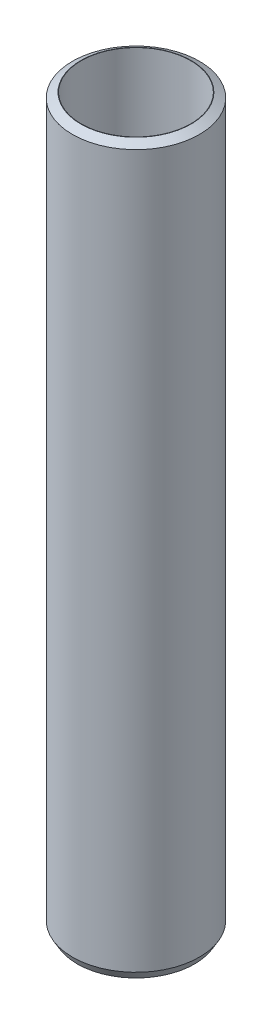
ISO-10303-21;
HEADER;
FILE_DESCRIPTION(('STEP AP214'),'2;1');
FILE_NAME('part.step','',(''),(''),'','','');
FILE_SCHEMA(('AUTOMOTIVE_DESIGN { 1 0 10303 214 1 1 1 1 }'));
ENDSEC;
DATA;
#1=APPLICATION_CONTEXT('core data for automotive mechanical design processes');
#2=APPLICATION_PROTOCOL_DEFINITION('international standard','automotive_design',2000,#1);
#3=PRODUCT_CONTEXT('',#1,'mechanical');
#4=PRODUCT('Part','Part','',(#3));
#5=PRODUCT_RELATED_PRODUCT_CATEGORY('part','',(#4));
#6=PRODUCT_DEFINITION_FORMATION('','',#4);
#7=PRODUCT_DEFINITION_CONTEXT('part definition',#1,'design');
#8=PRODUCT_DEFINITION('design','',#6,#7);
#9=PRODUCT_DEFINITION_SHAPE('','',#8);
#10=(LENGTH_UNIT() NAMED_UNIT(*) SI_UNIT(.MILLI.,.METRE.));
#11=(NAMED_UNIT(*) PLANE_ANGLE_UNIT() SI_UNIT($,.RADIAN.));
#12=(NAMED_UNIT(*) SI_UNIT($,.STERADIAN.) SOLID_ANGLE_UNIT());
#13=UNCERTAINTY_MEASURE_WITH_UNIT(LENGTH_MEASURE(1.E-05),#10,'distance_accuracy_value','');
#14=(GEOMETRIC_REPRESENTATION_CONTEXT(3) GLOBAL_UNCERTAINTY_ASSIGNED_CONTEXT((#13)) GLOBAL_UNIT_ASSIGNED_CONTEXT((#10,
#11,#12)) REPRESENTATION_CONTEXT('',''));
#15=CARTESIAN_POINT('',(0.,0.,0.));
#16=DIRECTION('',(0.,0.,1.));
#17=DIRECTION('',(1.,0.,0.));
#18=AXIS2_PLACEMENT_3D('',#15,#16,#17);
#19=CARTESIAN_POINT('',(0.,600.,0.));
#20=DIRECTION('',(0.,-1.,0.));
#21=DIRECTION('',(0.,0.,-1.));
#22=AXIS2_PLACEMENT_3D('',#19,#20,#21);
#23=CYLINDRICAL_SURFACE('',#22,52.5);
#24=CARTESIAN_POINT('',(0.,596.009307813276,0.));
#25=DIRECTION('',(0.,1.,0.));
#26=DIRECTION('',(0.,0.,1.));
#27=AXIS2_PLACEMENT_3D('',#24,#25,#26);
#28=CIRCLE('',#27,52.5);
#29=CARTESIAN_POINT('',(0.,596.009307813276,52.5));
#30=VERTEX_POINT('',#29);
#31=EDGE_CURVE('E50',#30,#30,#28,.F.);
#32=ORIENTED_EDGE('',*,*,#31,.T.);
#33=EDGE_LOOP('',(#32));
#34=FACE_BOUND('',#33,.T.);
#35=CARTESIAN_POINT('',(0.,6.91208162477497,0.));
#36=DIRECTION('',(0.,1.,0.));
#37=DIRECTION('',(0.,0.,1.));
#38=AXIS2_PLACEMENT_3D('',#35,#36,#37);
#39=CIRCLE('',#38,52.5);
#40=CARTESIAN_POINT('',(0.,6.91208162477497,52.5));
#41=VERTEX_POINT('',#40);
#42=EDGE_CURVE('E51',#41,#41,#39,.T.);
#43=ORIENTED_EDGE('',*,*,#42,.T.);
#44=EDGE_LOOP('',(#43));
#45=FACE_BOUND('',#44,.T.);
#46=ADVANCED_FACE('F39',(#34,#45),#23,.T.);
#47=CARTESIAN_POINT('',(0.,600.,0.));
#48=DIRECTION('',(0.,1.,0.));
#49=DIRECTION('',(0.,0.,1.));
#50=AXIS2_PLACEMENT_3D('',#47,#48,#49);
#51=PLANE('',#50);
#52=CARTESIAN_POINT('',(0.,600.,0.));
#53=DIRECTION('',(0.,1.,0.));
#54=DIRECTION('',(0.,0.,1.));
#55=AXIS2_PLACEMENT_3D('',#52,#53,#54);
#56=CIRCLE('',#55,45.5879183752254);
#57=CARTESIAN_POINT('',(0.,600.,45.5879183752254));
#58=VERTEX_POINT('',#57);
#59=EDGE_CURVE('E54',#58,#58,#56,.T.);
#60=ORIENTED_EDGE('',*,*,#59,.T.);
#61=EDGE_LOOP('',(#60));
#62=FACE_BOUND('',#61,.T.);
#63=CARTESIAN_POINT('',(0.,600.,0.));
#64=DIRECTION('',(0.,1.,0.));
#65=DIRECTION('',(0.,0.,1.));
#66=AXIS2_PLACEMENT_3D('',#63,#64,#65);
#67=CIRCLE('',#66,45.2888110798091);
#68=CARTESIAN_POINT('',(0.,600.,45.2888110798091));
#69=VERTEX_POINT('',#68);
#70=EDGE_CURVE('E58',#69,#69,#67,.T.);
#71=ORIENTED_EDGE('',*,*,#70,.F.);
#72=EDGE_LOOP('',(#71));
#73=FACE_BOUND('',#72,.T.);
#74=ADVANCED_FACE('F69',(#62,#73),#51,.T.);
#75=CARTESIAN_POINT('',(0.,0.,0.));
#76=DIRECTION('',(0.,1.,0.));
#77=DIRECTION('',(0.,0.,1.));
#78=AXIS2_PLACEMENT_3D('',#75,#76,#77);
#79=PLANE('',#78);
#80=CARTESIAN_POINT('',(0.,0.,0.));
#81=DIRECTION('',(0.,1.,0.));
#82=DIRECTION('',(0.,0.,1.));
#83=AXIS2_PLACEMENT_3D('',#80,#81,#82);
#84=CIRCLE('',#83,48.5093078132755);
#85=CARTESIAN_POINT('',(0.,0.,48.5093078132755));
#86=VERTEX_POINT('',#85);
#87=EDGE_CURVE('E10',#86,#86,#84,.F.);
#88=ORIENTED_EDGE('',*,*,#87,.T.);
#89=EDGE_LOOP('',(#88));
#90=FACE_BOUND('',#89,.T.);
#91=CARTESIAN_POINT('',(0.,0.,0.));
#92=DIRECTION('',(0.,1.,0.));
#93=DIRECTION('',(0.,0.,1.));
#94=AXIS2_PLACEMENT_3D('',#91,#92,#93);
#95=CIRCLE('',#94,45.2888110798091);
#96=CARTESIAN_POINT('',(0.,0.,45.2888110798091));
#97=VERTEX_POINT('',#96);
#98=EDGE_CURVE('E63',#97,#97,#95,.T.);
#99=ORIENTED_EDGE('',*,*,#98,.T.);
#100=EDGE_LOOP('',(#99));
#101=FACE_BOUND('',#100,.T.);
#102=ADVANCED_FACE('F75',(#90,#101),#79,.F.);
#103=CARTESIAN_POINT('',(0.,600.,0.));
#104=DIRECTION('',(0.,-1.,0.));
#105=DIRECTION('',(0.,0.,-1.));
#106=AXIS2_PLACEMENT_3D('',#103,#104,#105);
#107=CYLINDRICAL_SURFACE('',#106,45.2888110798091);
#108=ORIENTED_EDGE('',*,*,#70,.T.);
#109=EDGE_LOOP('',(#108));
#110=FACE_BOUND('',#109,.T.);
#111=ORIENTED_EDGE('',*,*,#98,.F.);
#112=EDGE_LOOP('',(#111));
#113=FACE_BOUND('',#112,.T.);
#114=ADVANCED_FACE('F70',(#110,#113),#107,.F.);
#115=CARTESIAN_POINT('',(0.,600.,0.));
#116=DIRECTION('',(0.,-1.,0.));
#117=DIRECTION('',(0.,0.,-1.));
#118=AXIS2_PLACEMENT_3D('',#115,#116,#117);
#119=CONICAL_SURFACE('',#118,45.5879183752254,1.0471975511966);
#120=ORIENTED_EDGE('',*,*,#31,.F.);
#121=EDGE_LOOP('',(#120));
#122=FACE_BOUND('',#121,.T.);
#123=ORIENTED_EDGE('',*,*,#59,.F.);
#124=EDGE_LOOP('',(#123));
#125=FACE_BOUND('',#124,.T.);
#126=ADVANCED_FACE('F81',(#122,#125),#119,.T.);
#127=CARTESIAN_POINT('',(0.,6.91208162477497,0.));
#128=DIRECTION('',(0.,1.,0.));
#129=DIRECTION('',(0.,0.,1.));
#130=AXIS2_PLACEMENT_3D('',#127,#128,#129);
#131=CONICAL_SURFACE('',#130,52.5,0.523598775598299);
#132=ORIENTED_EDGE('',*,*,#87,.F.);
#133=EDGE_LOOP('',(#132));
#134=FACE_BOUND('',#133,.T.);
#135=ORIENTED_EDGE('',*,*,#42,.F.);
#136=EDGE_LOOP('',(#135));
#137=FACE_BOUND('',#136,.T.);
#138=ADVANCED_FACE('F45',(#134,#137),#131,.T.);
#139=CLOSED_SHELL('',(#46,#74,#102,#114,#126,#138));
#140=MANIFOLD_SOLID_BREP('B2',#139);
#141=ADVANCED_BREP_SHAPE_REPRESENTATION('',(#18,#140),#14);
#142=SHAPE_DEFINITION_REPRESENTATION(#9,#141);
ENDSEC;
END-ISO-10303-21;
